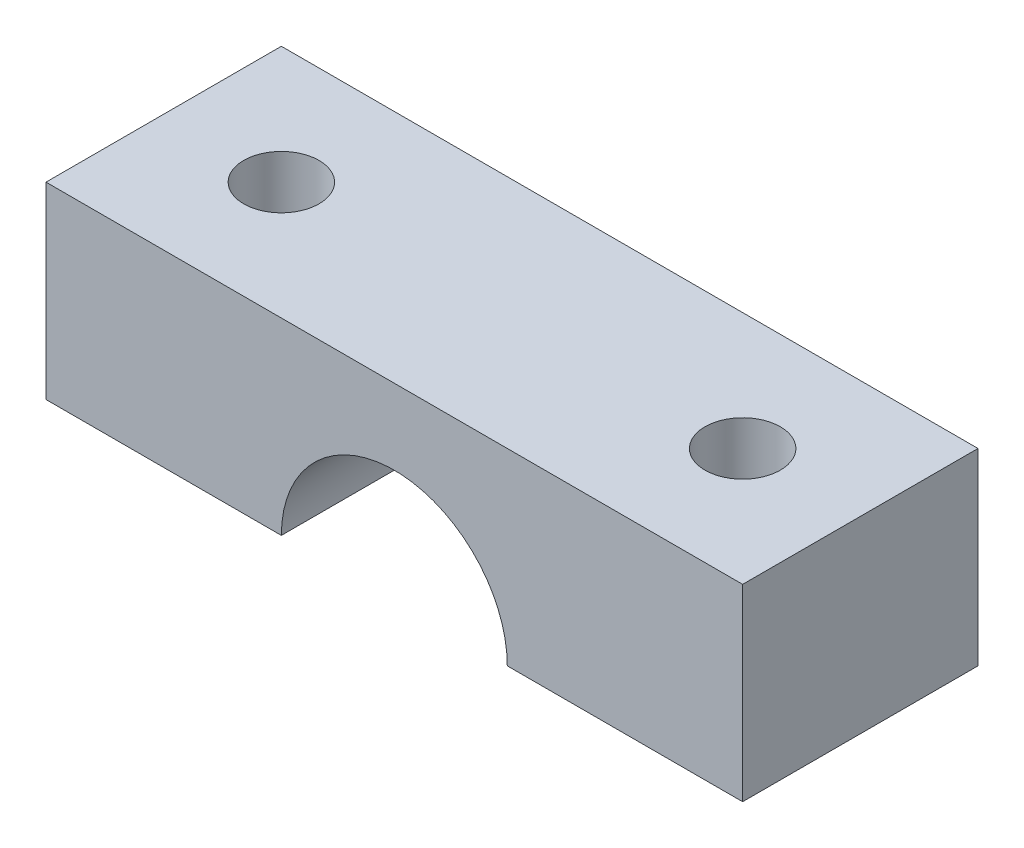
ISO-10303-21;
HEADER;
FILE_DESCRIPTION(('STEP AP214'),'2;1');
FILE_NAME('part.step','',(''),(''),'','','');
FILE_SCHEMA(('AUTOMOTIVE_DESIGN { 1 0 10303 214 1 1 1 1 }'));
ENDSEC;
DATA;
#1=APPLICATION_CONTEXT('core data for automotive mechanical design processes');
#2=APPLICATION_PROTOCOL_DEFINITION('international standard','automotive_design',2000,#1);
#3=PRODUCT_CONTEXT('',#1,'mechanical');
#4=PRODUCT('Part','Part','',(#3));
#5=PRODUCT_RELATED_PRODUCT_CATEGORY('part','',(#4));
#6=PRODUCT_DEFINITION_FORMATION('','',#4);
#7=PRODUCT_DEFINITION_CONTEXT('part definition',#1,'design');
#8=PRODUCT_DEFINITION('design','',#6,#7);
#9=PRODUCT_DEFINITION_SHAPE('','',#8);
#10=(LENGTH_UNIT() NAMED_UNIT(*) SI_UNIT(.MILLI.,.METRE.));
#11=(NAMED_UNIT(*) PLANE_ANGLE_UNIT() SI_UNIT($,.RADIAN.));
#12=(NAMED_UNIT(*) SI_UNIT($,.STERADIAN.) SOLID_ANGLE_UNIT());
#13=UNCERTAINTY_MEASURE_WITH_UNIT(LENGTH_MEASURE(1.E-05),#10,'distance_accuracy_value','');
#14=(GEOMETRIC_REPRESENTATION_CONTEXT(3) GLOBAL_UNCERTAINTY_ASSIGNED_CONTEXT((#13)) GLOBAL_UNIT_ASSIGNED_CONTEXT((#10,
#11,#12)) REPRESENTATION_CONTEXT('',''));
#15=CARTESIAN_POINT('',(0.,0.,0.));
#16=DIRECTION('',(0.,0.,1.));
#17=DIRECTION('',(1.,0.,0.));
#18=AXIS2_PLACEMENT_3D('',#15,#16,#17);
#19=CARTESIAN_POINT('',(0.,0.,0.));
#20=DIRECTION('',(0.,1.,0.));
#21=DIRECTION('',(0.,0.,1.));
#22=AXIS2_PLACEMENT_3D('',#19,#20,#21);
#23=PLANE('',#22);
#24=CARTESIAN_POINT('',(-24.6,0.,-5.));
#25=DIRECTION('',(0.,-1.,0.));
#26=DIRECTION('',(0.,0.,-1.));
#27=AXIS2_PLACEMENT_3D('',#24,#25,#26);
#28=CIRCLE('',#27,1.6);
#29=CARTESIAN_POINT('',(-24.6,0.,-6.6));
#30=VERTEX_POINT('',#29);
#31=EDGE_CURVE('E166',#30,#30,#28,.T.);
#32=ORIENTED_EDGE('',*,*,#31,.F.);
#33=EDGE_LOOP('',(#32));
#34=FACE_BOUND('',#33,.T.);
#35=DIRECTION('',(-1.,0.,0.));
#36=VECTOR('',#35,1.);
#37=CARTESIAN_POINT('',(0.,0.,-10.));
#38=LINE('',#37,#36);
#39=CARTESIAN_POINT('',(-19.6,0.,-10.));
#40=VERTEX_POINT('',#39);
#41=CARTESIAN_POINT('',(-29.6,0.,-10.));
#42=VERTEX_POINT('',#41);
#43=EDGE_CURVE('E150',#40,#42,#38,.T.);
#44=ORIENTED_EDGE('',*,*,#43,.F.);
#45=DIRECTION('',(0.,0.,1.));
#46=VECTOR('',#45,1.);
#47=CARTESIAN_POINT('',(-19.6,0.,-10.));
#48=LINE('',#47,#46);
#49=CARTESIAN_POINT('',(-19.6,0.,0.));
#50=VERTEX_POINT('',#49);
#51=EDGE_CURVE('E11',#40,#50,#48,.T.);
#52=ORIENTED_EDGE('',*,*,#51,.T.);
#53=DIRECTION('',(1.,0.,0.));
#54=VECTOR('',#53,1.);
#55=CARTESIAN_POINT('',(0.,0.,0.));
#56=LINE('',#55,#54);
#57=CARTESIAN_POINT('',(-29.6,0.,0.));
#58=VERTEX_POINT('',#57);
#59=EDGE_CURVE('E116',#58,#50,#56,.T.);
#60=ORIENTED_EDGE('',*,*,#59,.F.);
#61=DIRECTION('',(0.,0.,1.));
#62=VECTOR('',#61,1.);
#63=CARTESIAN_POINT('',(-29.6,0.,0.));
#64=LINE('',#63,#62);
#65=EDGE_CURVE('E125',#42,#58,#64,.T.);
#66=ORIENTED_EDGE('',*,*,#65,.F.);
#67=EDGE_LOOP('',(#44,#52,#60,#66));
#68=FACE_BOUND('',#67,.T.);
#69=ADVANCED_FACE('F45',(#34,#68),#23,.F.);
#70=CARTESIAN_POINT('',(0.,8.,0.));
#71=DIRECTION('',(-1.,0.,0.));
#72=DIRECTION('',(0.,0.,1.));
#73=AXIS2_PLACEMENT_3D('',#70,#71,#72);
#74=PLANE('',#73);
#75=DIRECTION('',(0.,0.,-1.));
#76=VECTOR('',#75,1.);
#77=CARTESIAN_POINT('',(0.,0.,0.));
#78=LINE('',#77,#76);
#79=CARTESIAN_POINT('',(0.,0.,0.));
#80=VERTEX_POINT('',#79);
#81=CARTESIAN_POINT('',(0.,0.,-10.));
#82=VERTEX_POINT('',#81);
#83=EDGE_CURVE('E123',#80,#82,#78,.T.);
#84=ORIENTED_EDGE('',*,*,#83,.T.);
#85=DIRECTION('',(0.,-1.,0.));
#86=VECTOR('',#85,1.);
#87=CARTESIAN_POINT('',(0.,8.,-10.));
#88=LINE('',#87,#86);
#89=CARTESIAN_POINT('',(0.,8.,-10.));
#90=VERTEX_POINT('',#89);
#91=EDGE_CURVE('E111',#90,#82,#88,.T.);
#92=ORIENTED_EDGE('',*,*,#91,.F.);
#93=DIRECTION('',(0.,0.,-1.));
#94=VECTOR('',#93,1.);
#95=CARTESIAN_POINT('',(0.,8.,0.));
#96=LINE('',#95,#94);
#97=CARTESIAN_POINT('',(0.,8.,0.));
#98=VERTEX_POINT('',#97);
#99=EDGE_CURVE('E129',#98,#90,#96,.T.);
#100=ORIENTED_EDGE('',*,*,#99,.F.);
#101=DIRECTION('',(0.,-1.,0.));
#102=VECTOR('',#101,1.);
#103=CARTESIAN_POINT('',(0.,8.,0.));
#104=LINE('',#103,#102);
#105=EDGE_CURVE('E134',#98,#80,#104,.T.);
#106=ORIENTED_EDGE('',*,*,#105,.T.);
#107=EDGE_LOOP('',(#84,#92,#100,#106));
#108=FACE_BOUND('',#107,.T.);
#109=ADVANCED_FACE('F47',(#108),#74,.F.);
#110=CARTESIAN_POINT('',(0.,8.,-10.));
#111=DIRECTION('',(0.,0.,1.));
#112=DIRECTION('',(1.,0.,0.));
#113=AXIS2_PLACEMENT_3D('',#110,#111,#112);
#114=PLANE('',#113);
#115=CARTESIAN_POINT('',(-10.,0.,-10.));
#116=VERTEX_POINT('',#115);
#117=EDGE_CURVE('E130',#82,#116,#38,.T.);
#118=ORIENTED_EDGE('',*,*,#117,.T.);
#119=CARTESIAN_POINT('',(-14.8,0.,-10.));
#120=DIRECTION('',(0.,0.,1.));
#121=DIRECTION('',(1.,0.,0.));
#122=AXIS2_PLACEMENT_3D('',#119,#120,#121);
#123=CIRCLE('',#122,4.8);
#124=EDGE_CURVE('E61',#116,#40,#123,.T.);
#125=ORIENTED_EDGE('',*,*,#124,.T.);
#126=ORIENTED_EDGE('',*,*,#43,.T.);
#127=DIRECTION('',(0.,-1.,0.));
#128=VECTOR('',#127,1.);
#129=CARTESIAN_POINT('',(-29.6,8.,-10.));
#130=LINE('',#129,#128);
#131=CARTESIAN_POINT('',(-29.6,8.,-10.));
#132=VERTEX_POINT('',#131);
#133=EDGE_CURVE('E140',#132,#42,#130,.T.);
#134=ORIENTED_EDGE('',*,*,#133,.F.);
#135=DIRECTION('',(-1.,0.,0.));
#136=VECTOR('',#135,1.);
#137=CARTESIAN_POINT('',(0.,8.,-10.));
#138=LINE('',#137,#136);
#139=EDGE_CURVE('E99',#90,#132,#138,.T.);
#140=ORIENTED_EDGE('',*,*,#139,.F.);
#141=ORIENTED_EDGE('',*,*,#91,.T.);
#142=EDGE_LOOP('',(#118,#125,#126,#134,#140,#141));
#143=FACE_BOUND('',#142,.T.);
#144=ADVANCED_FACE('F146',(#143),#114,.F.);
#145=CARTESIAN_POINT('',(-29.6,8.,0.));
#146=DIRECTION('',(1.,0.,0.));
#147=DIRECTION('',(0.,0.,-1.));
#148=AXIS2_PLACEMENT_3D('',#145,#146,#147);
#149=PLANE('',#148);
#150=ORIENTED_EDGE('',*,*,#65,.T.);
#151=DIRECTION('',(0.,-1.,0.));
#152=VECTOR('',#151,1.);
#153=CARTESIAN_POINT('',(-29.6,8.,0.));
#154=LINE('',#153,#152);
#155=CARTESIAN_POINT('',(-29.6,8.,0.));
#156=VERTEX_POINT('',#155);
#157=EDGE_CURVE('E137',#156,#58,#154,.T.);
#158=ORIENTED_EDGE('',*,*,#157,.F.);
#159=DIRECTION('',(0.,0.,1.));
#160=VECTOR('',#159,1.);
#161=CARTESIAN_POINT('',(-29.6,8.,0.));
#162=LINE('',#161,#160);
#163=EDGE_CURVE('E159',#132,#156,#162,.T.);
#164=ORIENTED_EDGE('',*,*,#163,.F.);
#165=ORIENTED_EDGE('',*,*,#133,.T.);
#166=EDGE_LOOP('',(#150,#158,#164,#165));
#167=FACE_BOUND('',#166,.T.);
#168=ADVANCED_FACE('F213',(#167),#149,.F.);
#169=CARTESIAN_POINT('',(0.,8.,0.));
#170=DIRECTION('',(0.,0.,-1.));
#171=DIRECTION('',(-1.,0.,0.));
#172=AXIS2_PLACEMENT_3D('',#169,#170,#171);
#173=PLANE('',#172);
#174=ORIENTED_EDGE('',*,*,#59,.T.);
#175=CARTESIAN_POINT('',(-14.8,0.,0.));
#176=DIRECTION('',(0.,0.,1.));
#177=DIRECTION('',(1.,0.,0.));
#178=AXIS2_PLACEMENT_3D('',#175,#176,#177);
#179=CIRCLE('',#178,4.8);
#180=CARTESIAN_POINT('',(-10.,0.,0.));
#181=VERTEX_POINT('',#180);
#182=EDGE_CURVE('E107',#181,#50,#179,.T.);
#183=ORIENTED_EDGE('',*,*,#182,.F.);
#184=EDGE_CURVE('E91',#181,#80,#56,.T.);
#185=ORIENTED_EDGE('',*,*,#184,.T.);
#186=ORIENTED_EDGE('',*,*,#105,.F.);
#187=DIRECTION('',(1.,0.,0.));
#188=VECTOR('',#187,1.);
#189=CARTESIAN_POINT('',(0.,8.,0.));
#190=LINE('',#189,#188);
#191=EDGE_CURVE('E70',#156,#98,#190,.T.);
#192=ORIENTED_EDGE('',*,*,#191,.F.);
#193=ORIENTED_EDGE('',*,*,#157,.T.);
#194=EDGE_LOOP('',(#174,#183,#185,#186,#192,#193));
#195=FACE_BOUND('',#194,.T.);
#196=ADVANCED_FACE('F113',(#195),#173,.F.);
#197=CARTESIAN_POINT('',(0.,8.,0.));
#198=DIRECTION('',(0.,1.,0.));
#199=DIRECTION('',(0.,0.,1.));
#200=AXIS2_PLACEMENT_3D('',#197,#198,#199);
#201=PLANE('',#200);
#202=CARTESIAN_POINT('',(-5.,8.,-5.));
#203=DIRECTION('',(0.,-1.,0.));
#204=DIRECTION('',(0.,0.,-1.));
#205=AXIS2_PLACEMENT_3D('',#202,#203,#204);
#206=CIRCLE('',#205,1.6);
#207=CARTESIAN_POINT('',(-5.,8.,-6.6));
#208=VERTEX_POINT('',#207);
#209=EDGE_CURVE('E170',#208,#208,#206,.T.);
#210=ORIENTED_EDGE('',*,*,#209,.T.);
#211=EDGE_LOOP('',(#210));
#212=FACE_BOUND('',#211,.T.);
#213=CARTESIAN_POINT('',(-24.6,8.,-5.));
#214=DIRECTION('',(0.,-1.,0.));
#215=DIRECTION('',(0.,0.,-1.));
#216=AXIS2_PLACEMENT_3D('',#213,#214,#215);
#217=CIRCLE('',#216,1.6);
#218=CARTESIAN_POINT('',(-24.6,8.,-6.6));
#219=VERTEX_POINT('',#218);
#220=EDGE_CURVE('E118',#219,#219,#217,.T.);
#221=ORIENTED_EDGE('',*,*,#220,.T.);
#222=EDGE_LOOP('',(#221));
#223=FACE_BOUND('',#222,.T.);
#224=ORIENTED_EDGE('',*,*,#99,.T.);
#225=ORIENTED_EDGE('',*,*,#139,.T.);
#226=ORIENTED_EDGE('',*,*,#163,.T.);
#227=ORIENTED_EDGE('',*,*,#191,.T.);
#228=EDGE_LOOP('',(#224,#225,#226,#227));
#229=FACE_BOUND('',#228,.T.);
#230=ADVANCED_FACE('F182',(#212,#223,#229),#201,.T.);
#231=CARTESIAN_POINT('',(-5.,0.,-5.));
#232=DIRECTION('',(0.,-1.,0.));
#233=DIRECTION('',(0.,0.,-1.));
#234=AXIS2_PLACEMENT_3D('',#231,#232,#233);
#235=CIRCLE('',#234,1.6);
#236=CARTESIAN_POINT('',(-5.,0.,-6.6));
#237=VERTEX_POINT('',#236);
#238=EDGE_CURVE('E174',#237,#237,#235,.T.);
#239=ORIENTED_EDGE('',*,*,#238,.F.);
#240=EDGE_LOOP('',(#239));
#241=FACE_BOUND('',#240,.T.);
#242=ORIENTED_EDGE('',*,*,#184,.F.);
#243=DIRECTION('',(0.,0.,1.));
#244=VECTOR('',#243,1.);
#245=CARTESIAN_POINT('',(-10.,0.,-10.));
#246=LINE('',#245,#244);
#247=EDGE_CURVE('E54',#181,#116,#246,.F.);
#248=ORIENTED_EDGE('',*,*,#247,.T.);
#249=ORIENTED_EDGE('',*,*,#117,.F.);
#250=ORIENTED_EDGE('',*,*,#83,.F.);
#251=EDGE_LOOP('',(#242,#248,#249,#250));
#252=FACE_BOUND('',#251,.T.);
#253=ADVANCED_FACE('F121',(#241,#252),#23,.F.);
#254=CARTESIAN_POINT('',(-14.8,0.,-10.));
#255=DIRECTION('',(0.,0.,1.));
#256=DIRECTION('',(1.,0.,0.));
#257=AXIS2_PLACEMENT_3D('',#254,#255,#256);
#258=CYLINDRICAL_SURFACE('',#257,4.8);
#259=ORIENTED_EDGE('',*,*,#124,.F.);
#260=ORIENTED_EDGE('',*,*,#247,.F.);
#261=ORIENTED_EDGE('',*,*,#182,.T.);
#262=ORIENTED_EDGE('',*,*,#51,.F.);
#263=EDGE_LOOP('',(#259,#260,#261,#262));
#264=FACE_BOUND('',#263,.T.);
#265=ADVANCED_FACE('F106',(#264),#258,.F.);
#266=CARTESIAN_POINT('',(-24.6,8.,-5.));
#267=DIRECTION('',(0.,-1.,0.));
#268=DIRECTION('',(0.,0.,-1.));
#269=AXIS2_PLACEMENT_3D('',#266,#267,#268);
#270=CYLINDRICAL_SURFACE('',#269,1.6);
#271=ORIENTED_EDGE('',*,*,#220,.F.);
#272=EDGE_LOOP('',(#271));
#273=FACE_BOUND('',#272,.T.);
#274=ORIENTED_EDGE('',*,*,#31,.T.);
#275=EDGE_LOOP('',(#274));
#276=FACE_BOUND('',#275,.T.);
#277=ADVANCED_FACE('F188',(#273,#276),#270,.F.);
#278=CARTESIAN_POINT('',(-5.,8.,-5.));
#279=DIRECTION('',(0.,-1.,0.));
#280=DIRECTION('',(0.,0.,-1.));
#281=AXIS2_PLACEMENT_3D('',#278,#279,#280);
#282=CYLINDRICAL_SURFACE('',#281,1.6);
#283=ORIENTED_EDGE('',*,*,#209,.F.);
#284=EDGE_LOOP('',(#283));
#285=FACE_BOUND('',#284,.T.);
#286=ORIENTED_EDGE('',*,*,#238,.T.);
#287=EDGE_LOOP('',(#286));
#288=FACE_BOUND('',#287,.T.);
#289=ADVANCED_FACE('F185',(#285,#288),#282,.F.);
#290=CLOSED_SHELL('',(#69,#109,#144,#168,#196,#230,#253,#265,#277,#289));
#291=MANIFOLD_SOLID_BREP('B2',#290);
#292=ADVANCED_BREP_SHAPE_REPRESENTATION('',(#18,#291),#14);
#293=SHAPE_DEFINITION_REPRESENTATION(#9,#292);
ENDSEC;
END-ISO-10303-21;
